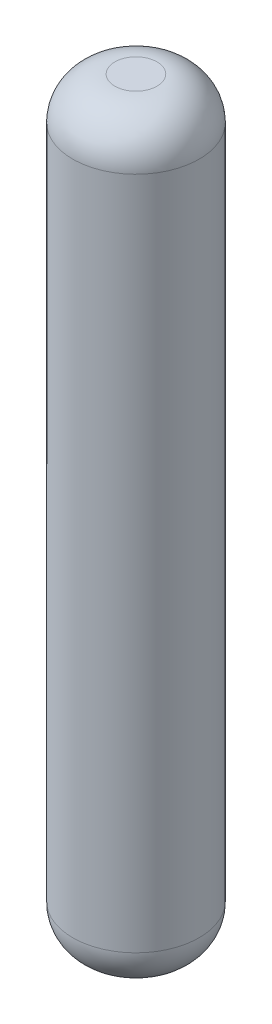
ISO-10303-21;
HEADER;
FILE_DESCRIPTION(('STEP AP214'),'2;1');
FILE_NAME('part.step','',(''),(''),'','','');
FILE_SCHEMA(('AUTOMOTIVE_DESIGN { 1 0 10303 214 1 1 1 1 }'));
ENDSEC;
DATA;
#1=APPLICATION_CONTEXT('core data for automotive mechanical design processes');
#2=APPLICATION_PROTOCOL_DEFINITION('international standard','automotive_design',2000,#1);
#3=PRODUCT_CONTEXT('',#1,'mechanical');
#4=PRODUCT('Part','Part','',(#3));
#5=PRODUCT_RELATED_PRODUCT_CATEGORY('part','',(#4));
#6=PRODUCT_DEFINITION_FORMATION('','',#4);
#7=PRODUCT_DEFINITION_CONTEXT('part definition',#1,'design');
#8=PRODUCT_DEFINITION('design','',#6,#7);
#9=PRODUCT_DEFINITION_SHAPE('','',#8);
#10=(LENGTH_UNIT() NAMED_UNIT(*) SI_UNIT(.MILLI.,.METRE.));
#11=(NAMED_UNIT(*) PLANE_ANGLE_UNIT() SI_UNIT($,.RADIAN.));
#12=(NAMED_UNIT(*) SI_UNIT($,.STERADIAN.) SOLID_ANGLE_UNIT());
#13=UNCERTAINTY_MEASURE_WITH_UNIT(LENGTH_MEASURE(1.E-05),#10,'distance_accuracy_value','');
#14=(GEOMETRIC_REPRESENTATION_CONTEXT(3) GLOBAL_UNCERTAINTY_ASSIGNED_CONTEXT((#13)) GLOBAL_UNIT_ASSIGNED_CONTEXT((#10,
#11,#12)) REPRESENTATION_CONTEXT('',''));
#15=CARTESIAN_POINT('',(0.,0.,0.));
#16=DIRECTION('',(0.,0.,1.));
#17=DIRECTION('',(1.,0.,0.));
#18=AXIS2_PLACEMENT_3D('',#15,#16,#17);
#19=CARTESIAN_POINT('',(-2.0263549688116,-1.19382022471909,0.));
#20=DIRECTION('',(0.,1.,0.));
#21=DIRECTION('',(-1.,0.,0.));
#22=AXIS2_PLACEMENT_3D('',#19,#20,#21);
#23=DEGENERATE_TOROIDAL_SURFACE('',#22,0.5,1.,.T.);
#24=CARTESIAN_POINT('',(-2.0263549688116,-0.193820224719091,0.));
#25=DIRECTION('',(0.,1.,0.));
#26=DIRECTION('',(-1.,0.,0.));
#27=AXIS2_PLACEMENT_3D('',#24,#25,#26);
#28=CIRCLE('',#27,0.499999999999993);
#29=CARTESIAN_POINT('',(-2.52635496881159,-0.193820224719091,0.));
#30=VERTEX_POINT('',#29);
#31=EDGE_CURVE('E10',#30,#30,#28,.T.);
#32=ORIENTED_EDGE('',*,*,#31,.F.);
#33=EDGE_LOOP('',(#32));
#34=FACE_BOUND('',#33,.T.);
#35=CARTESIAN_POINT('',(-2.0263549688116,-1.1938202247191,0.));
#36=DIRECTION('',(0.,1.,0.));
#37=DIRECTION('',(-1.,0.,0.));
#38=AXIS2_PLACEMENT_3D('',#35,#36,#37);
#39=CIRCLE('',#38,1.5);
#40=CARTESIAN_POINT('',(-3.5263549688116,-1.1938202247191,0.));
#41=VERTEX_POINT('',#40);
#42=EDGE_CURVE('E45',#41,#41,#39,.T.);
#43=ORIENTED_EDGE('',*,*,#42,.T.);
#44=EDGE_LOOP('',(#43));
#45=FACE_BOUND('',#44,.T.);
#46=ADVANCED_FACE('F31',(#34,#45),#23,.T.);
#47=CARTESIAN_POINT('',(-1.52635496881161,-0.193820224719091,0.));
#48=DIRECTION('',(0.,-1.,0.));
#49=DIRECTION('',(1.,0.,0.));
#50=AXIS2_PLACEMENT_3D('',#47,#48,#49);
#51=PLANE('',#50);
#52=ORIENTED_EDGE('',*,*,#31,.T.);
#53=EDGE_LOOP('',(#52));
#54=FACE_BOUND('',#53,.T.);
#55=ADVANCED_FACE('F65',(#54),#51,.F.);
#56=CARTESIAN_POINT('',(-1.5263549688116,-18.1938202247191,0.));
#57=DIRECTION('',(0.,1.,0.));
#58=DIRECTION('',(-1.,0.,0.));
#59=AXIS2_PLACEMENT_3D('',#56,#57,#58);
#60=PLANE('',#59);
#61=CARTESIAN_POINT('',(-2.0263549688116,-18.1938202247191,0.));
#62=DIRECTION('',(0.,1.,0.));
#63=DIRECTION('',(-1.,0.,0.));
#64=AXIS2_PLACEMENT_3D('',#61,#62,#63);
#65=CIRCLE('',#64,0.499999999999992);
#66=CARTESIAN_POINT('',(-2.52635496881159,-18.1938202247191,0.));
#67=VERTEX_POINT('',#66);
#68=EDGE_CURVE('E37',#67,#67,#65,.T.);
#69=ORIENTED_EDGE('',*,*,#68,.F.);
#70=EDGE_LOOP('',(#69));
#71=FACE_BOUND('',#70,.T.);
#72=ADVANCED_FACE('F60',(#71),#60,.F.);
#73=CARTESIAN_POINT('',(-2.0263549688116,-17.1938202247191,0.));
#74=DIRECTION('',(0.,1.,0.));
#75=DIRECTION('',(-1.,0.,0.));
#76=AXIS2_PLACEMENT_3D('',#73,#74,#75);
#77=DEGENERATE_TOROIDAL_SURFACE('',#76,0.5,1.,.T.);
#78=CARTESIAN_POINT('',(-2.0263549688116,-17.1938202247191,0.));
#79=DIRECTION('',(0.,1.,0.));
#80=DIRECTION('',(-1.,0.,0.));
#81=AXIS2_PLACEMENT_3D('',#78,#79,#80);
#82=CIRCLE('',#81,1.5);
#83=CARTESIAN_POINT('',(-3.5263549688116,-17.1938202247191,0.));
#84=VERTEX_POINT('',#83);
#85=EDGE_CURVE('E41',#84,#84,#82,.T.);
#86=ORIENTED_EDGE('',*,*,#85,.F.);
#87=EDGE_LOOP('',(#86));
#88=FACE_BOUND('',#87,.T.);
#89=ORIENTED_EDGE('',*,*,#68,.T.);
#90=EDGE_LOOP('',(#89));
#91=FACE_BOUND('',#90,.T.);
#92=ADVANCED_FACE('F55',(#88,#91),#77,.T.);
#93=CARTESIAN_POINT('',(-2.0263549688116,-0.193820224719091,0.));
#94=DIRECTION('',(0.,1.,0.));
#95=DIRECTION('',(-1.,0.,0.));
#96=AXIS2_PLACEMENT_3D('',#93,#94,#95);
#97=CYLINDRICAL_SURFACE('',#96,1.5);
#98=ORIENTED_EDGE('',*,*,#42,.F.);
#99=EDGE_LOOP('',(#98));
#100=FACE_BOUND('',#99,.T.);
#101=ORIENTED_EDGE('',*,*,#85,.T.);
#102=EDGE_LOOP('',(#101));
#103=FACE_BOUND('',#102,.T.);
#104=ADVANCED_FACE('F52',(#100,#103),#97,.T.);
#105=CLOSED_SHELL('',(#46,#55,#72,#92,#104));
#106=MANIFOLD_SOLID_BREP('B2',#105);
#107=ADVANCED_BREP_SHAPE_REPRESENTATION('',(#18,#106),#14);
#108=SHAPE_DEFINITION_REPRESENTATION(#9,#107);
ENDSEC;
END-ISO-10303-21;
